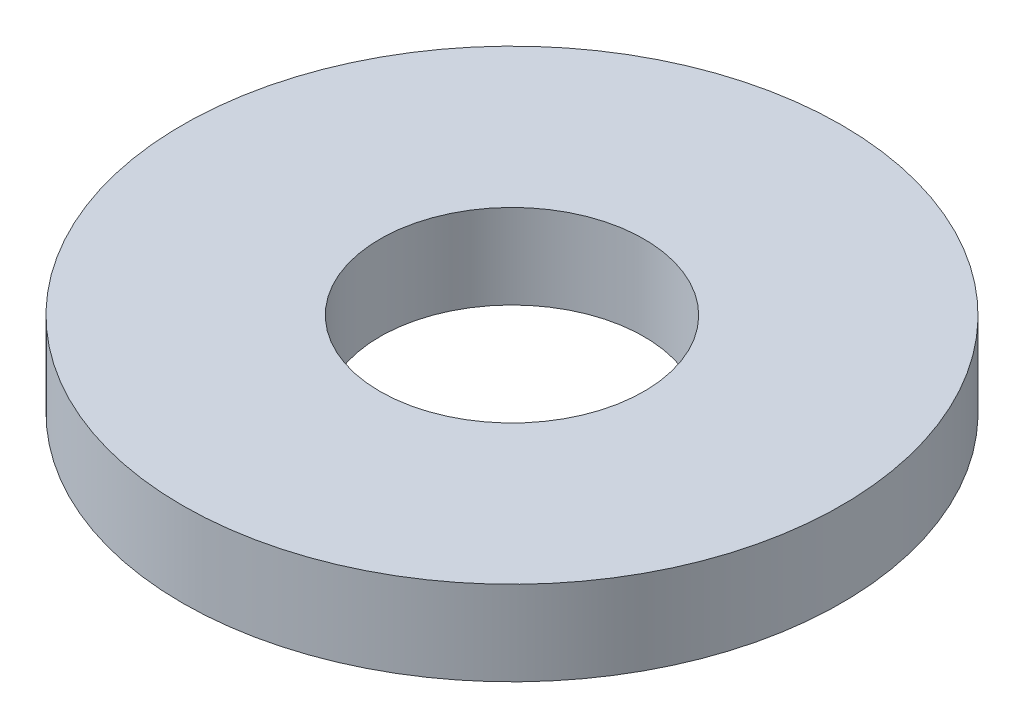
ISO-10303-21;
HEADER;
FILE_DESCRIPTION(('STEP AP214'),'2;1');
FILE_NAME('part.step','',(''),(''),'','','');
FILE_SCHEMA(('AUTOMOTIVE_DESIGN { 1 0 10303 214 1 1 1 1 }'));
ENDSEC;
DATA;
#1=APPLICATION_CONTEXT('core data for automotive mechanical design processes');
#2=APPLICATION_PROTOCOL_DEFINITION('international standard','automotive_design',2000,#1);
#3=PRODUCT_CONTEXT('',#1,'mechanical');
#4=PRODUCT('Part','Part','',(#3));
#5=PRODUCT_RELATED_PRODUCT_CATEGORY('part','',(#4));
#6=PRODUCT_DEFINITION_FORMATION('','',#4);
#7=PRODUCT_DEFINITION_CONTEXT('part definition',#1,'design');
#8=PRODUCT_DEFINITION('design','',#6,#7);
#9=PRODUCT_DEFINITION_SHAPE('','',#8);
#10=(LENGTH_UNIT() NAMED_UNIT(*) SI_UNIT(.MILLI.,.METRE.));
#11=(NAMED_UNIT(*) PLANE_ANGLE_UNIT() SI_UNIT($,.RADIAN.));
#12=(NAMED_UNIT(*) SI_UNIT($,.STERADIAN.) SOLID_ANGLE_UNIT());
#13=UNCERTAINTY_MEASURE_WITH_UNIT(LENGTH_MEASURE(1.E-05),#10,'distance_accuracy_value','');
#14=(GEOMETRIC_REPRESENTATION_CONTEXT(3) GLOBAL_UNCERTAINTY_ASSIGNED_CONTEXT((#13)) GLOBAL_UNIT_ASSIGNED_CONTEXT((#10,
#11,#12)) REPRESENTATION_CONTEXT('',''));
#15=CARTESIAN_POINT('',(0.,0.,0.));
#16=DIRECTION('',(0.,0.,1.));
#17=DIRECTION('',(1.,0.,0.));
#18=AXIS2_PLACEMENT_3D('',#15,#16,#17);
#19=CARTESIAN_POINT('',(0.,1.016,0.));
#20=DIRECTION('',(0.,-1.,0.));
#21=DIRECTION('',(0.,0.,-1.));
#22=AXIS2_PLACEMENT_3D('',#19,#20,#21);
#23=CYLINDRICAL_SURFACE('',#22,3.9624);
#24=CARTESIAN_POINT('',(0.,1.016,0.));
#25=DIRECTION('',(0.,1.,0.));
#26=DIRECTION('',(0.,0.,1.));
#27=AXIS2_PLACEMENT_3D('',#24,#25,#26);
#28=CIRCLE('',#27,3.9624);
#29=CARTESIAN_POINT('',(0.,1.016,3.9624));
#30=VERTEX_POINT('',#29);
#31=EDGE_CURVE('E10',#30,#30,#28,.T.);
#32=ORIENTED_EDGE('',*,*,#31,.F.);
#33=EDGE_LOOP('',(#32));
#34=FACE_BOUND('',#33,.T.);
#35=CARTESIAN_POINT('',(0.,0.,0.));
#36=DIRECTION('',(0.,1.,0.));
#37=DIRECTION('',(0.,0.,1.));
#38=AXIS2_PLACEMENT_3D('',#35,#36,#37);
#39=CIRCLE('',#38,3.9624);
#40=CARTESIAN_POINT('',(0.,0.,3.9624));
#41=VERTEX_POINT('',#40);
#42=EDGE_CURVE('E31',#41,#41,#39,.T.);
#43=ORIENTED_EDGE('',*,*,#42,.T.);
#44=EDGE_LOOP('',(#43));
#45=FACE_BOUND('',#44,.T.);
#46=ADVANCED_FACE('F28',(#34,#45),#23,.T.);
#47=CARTESIAN_POINT('',(0.,1.016,0.));
#48=DIRECTION('',(0.,1.,0.));
#49=DIRECTION('',(0.,0.,1.));
#50=AXIS2_PLACEMENT_3D('',#47,#48,#49);
#51=PLANE('',#50);
#52=CARTESIAN_POINT('',(0.,1.016,0.));
#53=DIRECTION('',(0.,1.,0.));
#54=DIRECTION('',(0.,0.,1.));
#55=AXIS2_PLACEMENT_3D('',#52,#53,#54);
#56=CIRCLE('',#55,1.5875);
#57=CARTESIAN_POINT('',(0.,1.016,1.5875));
#58=VERTEX_POINT('',#57);
#59=EDGE_CURVE('E40',#58,#58,#56,.T.);
#60=ORIENTED_EDGE('',*,*,#59,.F.);
#61=EDGE_LOOP('',(#60));
#62=FACE_BOUND('',#61,.T.);
#63=ORIENTED_EDGE('',*,*,#31,.T.);
#64=EDGE_LOOP('',(#63));
#65=FACE_BOUND('',#64,.T.);
#66=ADVANCED_FACE('F55',(#62,#65),#51,.T.);
#67=CARTESIAN_POINT('',(0.,0.,0.));
#68=DIRECTION('',(0.,1.,0.));
#69=DIRECTION('',(0.,0.,1.));
#70=AXIS2_PLACEMENT_3D('',#67,#68,#69);
#71=PLANE('',#70);
#72=CARTESIAN_POINT('',(0.,0.,0.));
#73=DIRECTION('',(0.,1.,0.));
#74=DIRECTION('',(0.,0.,1.));
#75=AXIS2_PLACEMENT_3D('',#72,#73,#74);
#76=CIRCLE('',#75,1.5875);
#77=CARTESIAN_POINT('',(0.,0.,1.5875));
#78=VERTEX_POINT('',#77);
#79=EDGE_CURVE('E38',#78,#78,#76,.T.);
#80=ORIENTED_EDGE('',*,*,#79,.T.);
#81=EDGE_LOOP('',(#80));
#82=FACE_BOUND('',#81,.T.);
#83=ORIENTED_EDGE('',*,*,#42,.F.);
#84=EDGE_LOOP('',(#83));
#85=FACE_BOUND('',#84,.T.);
#86=ADVANCED_FACE('F46',(#82,#85),#71,.F.);
#87=CARTESIAN_POINT('',(0.,0.,0.));
#88=DIRECTION('',(0.,1.,0.));
#89=DIRECTION('',(0.,0.,1.));
#90=AXIS2_PLACEMENT_3D('',#87,#88,#89);
#91=CYLINDRICAL_SURFACE('',#90,1.5875);
#92=ORIENTED_EDGE('',*,*,#79,.F.);
#93=EDGE_LOOP('',(#92));
#94=FACE_BOUND('',#93,.T.);
#95=ORIENTED_EDGE('',*,*,#59,.T.);
#96=EDGE_LOOP('',(#95));
#97=FACE_BOUND('',#96,.T.);
#98=ADVANCED_FACE('F49',(#94,#97),#91,.F.);
#99=CLOSED_SHELL('',(#46,#66,#86,#98));
#100=MANIFOLD_SOLID_BREP('B2',#99);
#101=ADVANCED_BREP_SHAPE_REPRESENTATION('',(#18,#100),#14);
#102=SHAPE_DEFINITION_REPRESENTATION(#9,#101);
ENDSEC;
END-ISO-10303-21;
